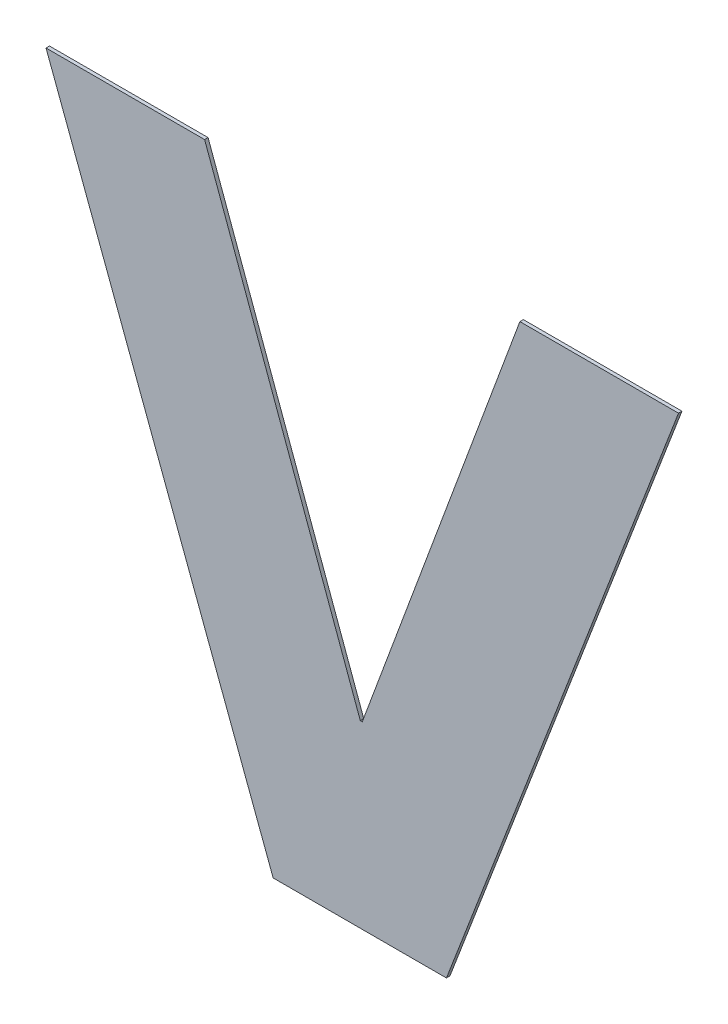
ISO-10303-21;
HEADER;
FILE_DESCRIPTION(('STEP AP214'),'2;1');
FILE_NAME('part.step','',(''),(''),'','','');
FILE_SCHEMA(('AUTOMOTIVE_DESIGN { 1 0 10303 214 1 1 1 1 }'));
ENDSEC;
DATA;
#1=APPLICATION_CONTEXT('core data for automotive mechanical design processes');
#2=APPLICATION_PROTOCOL_DEFINITION('international standard','automotive_design',2000,#1);
#3=PRODUCT_CONTEXT('',#1,'mechanical');
#4=PRODUCT('Part','Part','',(#3));
#5=PRODUCT_RELATED_PRODUCT_CATEGORY('part','',(#4));
#6=PRODUCT_DEFINITION_FORMATION('','',#4);
#7=PRODUCT_DEFINITION_CONTEXT('part definition',#1,'design');
#8=PRODUCT_DEFINITION('design','',#6,#7);
#9=PRODUCT_DEFINITION_SHAPE('','',#8);
#10=(LENGTH_UNIT() NAMED_UNIT(*) SI_UNIT(.MILLI.,.METRE.));
#11=(NAMED_UNIT(*) PLANE_ANGLE_UNIT() SI_UNIT($,.RADIAN.));
#12=(NAMED_UNIT(*) SI_UNIT($,.STERADIAN.) SOLID_ANGLE_UNIT());
#13=UNCERTAINTY_MEASURE_WITH_UNIT(LENGTH_MEASURE(1.E-05),#10,'distance_accuracy_value','');
#14=(GEOMETRIC_REPRESENTATION_CONTEXT(3) GLOBAL_UNCERTAINTY_ASSIGNED_CONTEXT((#13)) GLOBAL_UNIT_ASSIGNED_CONTEXT((#10,
#11,#12)) REPRESENTATION_CONTEXT('',''));
#15=CARTESIAN_POINT('',(0.,0.,0.));
#16=DIRECTION('',(0.,0.,1.));
#17=DIRECTION('',(1.,0.,0.));
#18=AXIS2_PLACEMENT_3D('',#15,#16,#17);
#19=CARTESIAN_POINT('',(-0.103687437590675,0.89969219015865,0.00015));
#20=DIRECTION('',(0.,-1.,0.));
#21=DIRECTION('',(0.,0.,-1.));
#22=AXIS2_PLACEMENT_3D('',#19,#20,#21);
#23=PLANE('',#22);
#24=DIRECTION('',(0.,0.,1.));
#25=VECTOR('',#24,1.);
#26=CARTESIAN_POINT('',(-0.0999274956990002,0.89969219015865,0.));
#27=LINE('',#26,#25);
#28=CARTESIAN_POINT('',(-0.0999274956990002,0.89969219015865,0.));
#29=VERTEX_POINT('',#28);
#30=CARTESIAN_POINT('',(-0.0999274956990002,0.89969219015865,0.00015));
#31=VERTEX_POINT('',#30);
#32=EDGE_CURVE('E11',#29,#31,#27,.T.);
#33=ORIENTED_EDGE('',*,*,#32,.T.);
#34=DIRECTION('',(-1.,0.,0.));
#35=VECTOR('',#34,1.);
#36=CARTESIAN_POINT('',(-0.0999274956990002,0.89969219015865,0.00015));
#37=LINE('',#36,#35);
#38=CARTESIAN_POINT('',(-0.10744737948235,0.89969219015865,0.00015));
#39=VERTEX_POINT('',#38);
#40=EDGE_CURVE('E24',#31,#39,#37,.T.);
#41=ORIENTED_EDGE('',*,*,#40,.T.);
#42=DIRECTION('',(0.,0.,1.));
#43=VECTOR('',#42,1.);
#44=CARTESIAN_POINT('',(-0.10744737948235,0.89969219015865,0.));
#45=LINE('',#44,#43);
#46=CARTESIAN_POINT('',(-0.10744737948235,0.89969219015865,0.));
#47=VERTEX_POINT('',#46);
#48=EDGE_CURVE('E141',#47,#39,#45,.T.);
#49=ORIENTED_EDGE('',*,*,#48,.F.);
#50=DIRECTION('',(-1.,0.,0.));
#51=VECTOR('',#50,1.);
#52=CARTESIAN_POINT('',(-0.0999274956990002,0.89969219015865,0.));
#53=LINE('',#52,#51);
#54=EDGE_CURVE('E139',#29,#47,#53,.T.);
#55=ORIENTED_EDGE('',*,*,#54,.F.);
#56=EDGE_LOOP('',(#33,#41,#49,#55));
#57=FACE_BOUND('',#56,.T.);
#58=ADVANCED_FACE('F17',(#57),#23,.T.);
#59=CARTESIAN_POINT('',(-0.112375870599,0.9128238842195,0.00015));
#60=DIRECTION('',(-0.936232902766256,-0.351380067416851,0.));
#61=DIRECTION('',(0.,0.,1.));
#62=AXIS2_PLACEMENT_3D('',#59,#60,#61);
#63=PLANE('',#62);
#64=ORIENTED_EDGE('',*,*,#48,.T.);
#65=DIRECTION('',(-0.351380067416851,0.936232902766256,0.));
#66=VECTOR('',#65,1.);
#67=CARTESIAN_POINT('',(-0.10744737948235,0.89969219015865,0.00015));
#68=LINE('',#67,#66);
#69=CARTESIAN_POINT('',(-0.11730436171565,0.92595557828035,0.00015));
#70=VERTEX_POINT('',#69);
#71=EDGE_CURVE('E137',#39,#70,#68,.T.);
#72=ORIENTED_EDGE('',*,*,#71,.T.);
#73=DIRECTION('',(0.,0.,1.));
#74=VECTOR('',#73,1.);
#75=CARTESIAN_POINT('',(-0.11730436171565,0.92595557828035,0.));
#76=LINE('',#75,#74);
#77=CARTESIAN_POINT('',(-0.11730436171565,0.92595557828035,0.));
#78=VERTEX_POINT('',#77);
#79=EDGE_CURVE('E134',#78,#70,#76,.T.);
#80=ORIENTED_EDGE('',*,*,#79,.F.);
#81=DIRECTION('',(-0.351380067416851,0.936232902766256,0.));
#82=VECTOR('',#81,1.);
#83=CARTESIAN_POINT('',(-0.10744737948235,0.89969219015865,0.));
#84=LINE('',#83,#82);
#85=EDGE_CURVE('E131',#47,#78,#84,.T.);
#86=ORIENTED_EDGE('',*,*,#85,.F.);
#87=EDGE_LOOP('',(#64,#72,#80,#86));
#88=FACE_BOUND('',#87,.T.);
#89=ADVANCED_FACE('F147',(#88),#63,.T.);
#90=CARTESIAN_POINT('',(-0.113863390907325,0.92595557828035,0.00015));
#91=DIRECTION('',(0.,1.,0.));
#92=DIRECTION('',(0.,0.,1.));
#93=AXIS2_PLACEMENT_3D('',#90,#91,#92);
#94=PLANE('',#93);
#95=ORIENTED_EDGE('',*,*,#79,.T.);
#96=DIRECTION('',(1.,0.,0.));
#97=VECTOR('',#96,1.);
#98=CARTESIAN_POINT('',(-0.11730436171565,0.92595557828035,0.00015));
#99=LINE('',#98,#97);
#100=CARTESIAN_POINT('',(-0.110422420099,0.92595557828035,0.00015));
#101=VERTEX_POINT('',#100);
#102=EDGE_CURVE('E129',#70,#101,#99,.T.);
#103=ORIENTED_EDGE('',*,*,#102,.T.);
#104=DIRECTION('',(0.,0.,1.));
#105=VECTOR('',#104,1.);
#106=CARTESIAN_POINT('',(-0.110422420099,0.92595557828035,0.));
#107=LINE('',#106,#105);
#108=CARTESIAN_POINT('',(-0.110422420099,0.92595557828035,0.));
#109=VERTEX_POINT('',#108);
#110=EDGE_CURVE('E126',#109,#101,#107,.T.);
#111=ORIENTED_EDGE('',*,*,#110,.F.);
#112=DIRECTION('',(1.,0.,0.));
#113=VECTOR('',#112,1.);
#114=CARTESIAN_POINT('',(-0.11730436171565,0.92595557828035,0.));
#115=LINE('',#114,#113);
#116=EDGE_CURVE('E123',#78,#109,#115,.T.);
#117=ORIENTED_EDGE('',*,*,#116,.F.);
#118=EDGE_LOOP('',(#95,#103,#111,#117));
#119=FACE_BOUND('',#118,.T.);
#120=ADVANCED_FACE('F153',(#119),#94,.T.);
#121=CARTESIAN_POINT('',(-0.107044093099,0.9167250276745,0.00015));
#122=DIRECTION('',(0.939080291965946,0.343697840029804,0.));
#123=DIRECTION('',(0.,0.,-1.));
#124=AXIS2_PLACEMENT_3D('',#121,#122,#123);
#125=PLANE('',#124);
#126=ORIENTED_EDGE('',*,*,#110,.T.);
#127=DIRECTION('',(0.343697840029804,-0.939080291965946,0.));
#128=VECTOR('',#127,1.);
#129=CARTESIAN_POINT('',(-0.110422420099,0.92595557828035,0.00015));
#130=LINE('',#129,#128);
#131=CARTESIAN_POINT('',(-0.103665766099,0.90749447706865,0.00015));
#132=VERTEX_POINT('',#131);
#133=EDGE_CURVE('E121',#101,#132,#130,.T.);
#134=ORIENTED_EDGE('',*,*,#133,.T.);
#135=DIRECTION('',(0.,0.,1.));
#136=VECTOR('',#135,1.);
#137=CARTESIAN_POINT('',(-0.103665766099,0.90749447706865,0.));
#138=LINE('',#137,#136);
#139=CARTESIAN_POINT('',(-0.103665766099,0.90749447706865,0.));
#140=VERTEX_POINT('',#139);
#141=EDGE_CURVE('E118',#140,#132,#138,.T.);
#142=ORIENTED_EDGE('',*,*,#141,.F.);
#143=DIRECTION('',(0.343697840029804,-0.939080291965946,0.));
#144=VECTOR('',#143,1.);
#145=CARTESIAN_POINT('',(-0.110422420099,0.92595557828035,0.));
#146=LINE('',#145,#144);
#147=EDGE_CURVE('E115',#109,#140,#146,.T.);
#148=ORIENTED_EDGE('',*,*,#147,.F.);
#149=EDGE_LOOP('',(#126,#134,#142,#148));
#150=FACE_BOUND('',#149,.T.);
#151=ADVANCED_FACE('F157',(#150),#125,.T.);
#152=CARTESIAN_POINT('',(-0.103623440174,0.90749447706865,0.00015));
#153=DIRECTION('',(0.,1.,0.));
#154=DIRECTION('',(0.,0.,1.));
#155=AXIS2_PLACEMENT_3D('',#152,#153,#154);
#156=PLANE('',#155);
#157=ORIENTED_EDGE('',*,*,#141,.T.);
#158=DIRECTION('',(1.,0.,0.));
#159=VECTOR('',#158,1.);
#160=CARTESIAN_POINT('',(-0.103665766099,0.90749447706865,0.00015));
#161=LINE('',#160,#159);
#162=CARTESIAN_POINT('',(-0.103581114249,0.90749447706865,0.00015));
#163=VERTEX_POINT('',#162);
#164=EDGE_CURVE('E113',#132,#163,#161,.T.);
#165=ORIENTED_EDGE('',*,*,#164,.T.);
#166=DIRECTION('',(0.,0.,1.));
#167=VECTOR('',#166,1.);
#168=CARTESIAN_POINT('',(-0.103581114249,0.90749447706865,0.));
#169=LINE('',#168,#167);
#170=CARTESIAN_POINT('',(-0.103581114249,0.90749447706865,0.));
#171=VERTEX_POINT('',#170);
#172=EDGE_CURVE('E110',#171,#163,#169,.T.);
#173=ORIENTED_EDGE('',*,*,#172,.F.);
#174=DIRECTION('',(1.,0.,0.));
#175=VECTOR('',#174,1.);
#176=CARTESIAN_POINT('',(-0.103665766099,0.90749447706865,0.));
#177=LINE('',#176,#175);
#178=EDGE_CURVE('E108',#140,#171,#177,.T.);
#179=ORIENTED_EDGE('',*,*,#178,.F.);
#180=EDGE_LOOP('',(#157,#165,#173,#179));
#181=FACE_BOUND('',#180,.T.);
#182=ADVANCED_FACE('F160',(#181),#156,.T.);
#183=CARTESIAN_POINT('',(-0.100160798932325,0.9167250276745,0.00015));
#184=DIRECTION('',(-0.937696048296048,0.34745664623083,0.));
#185=DIRECTION('',(0.,0.,1.));
#186=AXIS2_PLACEMENT_3D('',#183,#184,#185);
#187=PLANE('',#186);
#188=ORIENTED_EDGE('',*,*,#172,.T.);
#189=DIRECTION('',(0.34745664623083,0.937696048296048,0.));
#190=VECTOR('',#189,1.);
#191=CARTESIAN_POINT('',(-0.103581114249,0.90749447706865,0.00015));
#192=LINE('',#191,#190);
#193=CARTESIAN_POINT('',(-0.0967404836156502,0.92595557828035,0.00015));
#194=VERTEX_POINT('',#193);
#195=EDGE_CURVE('E106',#163,#194,#192,.T.);
#196=ORIENTED_EDGE('',*,*,#195,.T.);
#197=DIRECTION('',(0.,0.,1.));
#198=VECTOR('',#197,1.);
#199=CARTESIAN_POINT('',(-0.0967404836156502,0.92595557828035,0.));
#200=LINE('',#199,#198);
#201=CARTESIAN_POINT('',(-0.0967404836156502,0.92595557828035,0.));
#202=VERTEX_POINT('',#201);
#203=EDGE_CURVE('E104',#202,#194,#200,.T.);
#204=ORIENTED_EDGE('',*,*,#203,.F.);
#205=DIRECTION('',(0.34745664623083,0.937696048296048,0.));
#206=VECTOR('',#205,1.);
#207=CARTESIAN_POINT('',(-0.103581114249,0.90749447706865,0.));
#208=LINE('',#207,#206);
#209=EDGE_CURVE('E95',#171,#202,#208,.T.);
#210=ORIENTED_EDGE('',*,*,#209,.F.);
#211=EDGE_LOOP('',(#188,#196,#204,#210));
#212=FACE_BOUND('',#211,.T.);
#213=ADVANCED_FACE('F163',(#212),#187,.T.);
#214=CARTESIAN_POINT('',(-0.0932984968073252,0.92595557828035,0.00015));
#215=DIRECTION('',(0.,1.,0.));
#216=DIRECTION('',(0.,0.,1.));
#217=AXIS2_PLACEMENT_3D('',#214,#215,#216);
#218=PLANE('',#217);
#219=ORIENTED_EDGE('',*,*,#203,.T.);
#220=DIRECTION('',(1.,0.,0.));
#221=VECTOR('',#220,1.);
#222=CARTESIAN_POINT('',(-0.0967404836156502,0.92595557828035,0.00015));
#223=LINE('',#222,#221);
#224=CARTESIAN_POINT('',(-0.0898565099990002,0.92595557828035,0.00015));
#225=VERTEX_POINT('',#224);
#226=EDGE_CURVE('E84',#194,#225,#223,.T.);
#227=ORIENTED_EDGE('',*,*,#226,.T.);
#228=DIRECTION('',(0.,0.,1.));
#229=VECTOR('',#228,1.);
#230=CARTESIAN_POINT('',(-0.0898565099990002,0.92595557828035,0.));
#231=LINE('',#230,#229);
#232=CARTESIAN_POINT('',(-0.0898565099990002,0.92595557828035,0.));
#233=VERTEX_POINT('',#232);
#234=EDGE_CURVE('E78',#233,#225,#231,.T.);
#235=ORIENTED_EDGE('',*,*,#234,.F.);
#236=DIRECTION('',(1.,0.,0.));
#237=VECTOR('',#236,1.);
#238=CARTESIAN_POINT('',(-0.0967404836156502,0.92595557828035,0.));
#239=LINE('',#238,#237);
#240=EDGE_CURVE('E82',#202,#233,#239,.T.);
#241=ORIENTED_EDGE('',*,*,#240,.F.);
#242=EDGE_LOOP('',(#219,#227,#235,#241));
#243=FACE_BOUND('',#242,.T.);
#244=ADVANCED_FACE('F81',(#243),#218,.T.);
#245=CARTESIAN_POINT('',(-0.0948920028490002,0.9128238842195,0.00015));
#246=DIRECTION('',(0.933706263815722,-0.358039959936437,0.));
#247=DIRECTION('',(0.,0.,-1.));
#248=AXIS2_PLACEMENT_3D('',#245,#246,#247);
#249=PLANE('',#248);
#250=ORIENTED_EDGE('',*,*,#234,.T.);
#251=DIRECTION('',(-0.358039959936437,-0.933706263815722,0.));
#252=VECTOR('',#251,1.);
#253=CARTESIAN_POINT('',(-0.0898565099990002,0.92595557828035,0.00015));
#254=LINE('',#253,#252);
#255=EDGE_CURVE('E96',#225,#31,#254,.T.);
#256=ORIENTED_EDGE('',*,*,#255,.T.);
#257=ORIENTED_EDGE('',*,*,#32,.F.);
#258=DIRECTION('',(-0.358039959936437,-0.933706263815722,0.));
#259=VECTOR('',#258,1.);
#260=CARTESIAN_POINT('',(-0.0898565099990002,0.92595557828035,0.));
#261=LINE('',#260,#259);
#262=EDGE_CURVE('E92',#233,#29,#261,.T.);
#263=ORIENTED_EDGE('',*,*,#262,.F.);
#264=EDGE_LOOP('',(#250,#256,#257,#263));
#265=FACE_BOUND('',#264,.T.);
#266=ADVANCED_FACE('F98',(#265),#249,.T.);
#267=CARTESIAN_POINT('',(-0.103580435857325,0.89969219015865,0.));
#268=DIRECTION('',(0.,0.,1.));
#269=DIRECTION('',(1.,0.,0.));
#270=AXIS2_PLACEMENT_3D('',#267,#268,#269);
#271=PLANE('',#270);
#272=ORIENTED_EDGE('',*,*,#54,.T.);
#273=ORIENTED_EDGE('',*,*,#85,.T.);
#274=ORIENTED_EDGE('',*,*,#116,.T.);
#275=ORIENTED_EDGE('',*,*,#147,.T.);
#276=ORIENTED_EDGE('',*,*,#178,.T.);
#277=ORIENTED_EDGE('',*,*,#209,.T.);
#278=ORIENTED_EDGE('',*,*,#240,.T.);
#279=ORIENTED_EDGE('',*,*,#262,.T.);
#280=EDGE_LOOP('',(#272,#273,#274,#275,#276,#277,#278,#279));
#281=FACE_BOUND('',#280,.T.);
#282=ADVANCED_FACE('F91',(#281),#271,.F.);
#283=CARTESIAN_POINT('',(-0.103580435857325,0.89969219015865,0.00015));
#284=DIRECTION('',(0.,0.,1.));
#285=DIRECTION('',(1.,0.,0.));
#286=AXIS2_PLACEMENT_3D('',#283,#284,#285);
#287=PLANE('',#286);
#288=ORIENTED_EDGE('',*,*,#40,.F.);
#289=ORIENTED_EDGE('',*,*,#255,.F.);
#290=ORIENTED_EDGE('',*,*,#226,.F.);
#291=ORIENTED_EDGE('',*,*,#195,.F.);
#292=ORIENTED_EDGE('',*,*,#164,.F.);
#293=ORIENTED_EDGE('',*,*,#133,.F.);
#294=ORIENTED_EDGE('',*,*,#102,.F.);
#295=ORIENTED_EDGE('',*,*,#71,.F.);
#296=EDGE_LOOP('',(#288,#289,#290,#291,#292,#293,#294,#295));
#297=FACE_BOUND('',#296,.T.);
#298=ADVANCED_FACE('F149',(#297),#287,.T.);
#299=CLOSED_SHELL('',(#58,#89,#120,#151,#182,#213,#244,#266,#282,#298));
#300=MANIFOLD_SOLID_BREP('B1',#299);
#301=ADVANCED_BREP_SHAPE_REPRESENTATION('',(#18,#300),#14);
#302=SHAPE_DEFINITION_REPRESENTATION(#9,#301);
ENDSEC;
END-ISO-10303-21;
